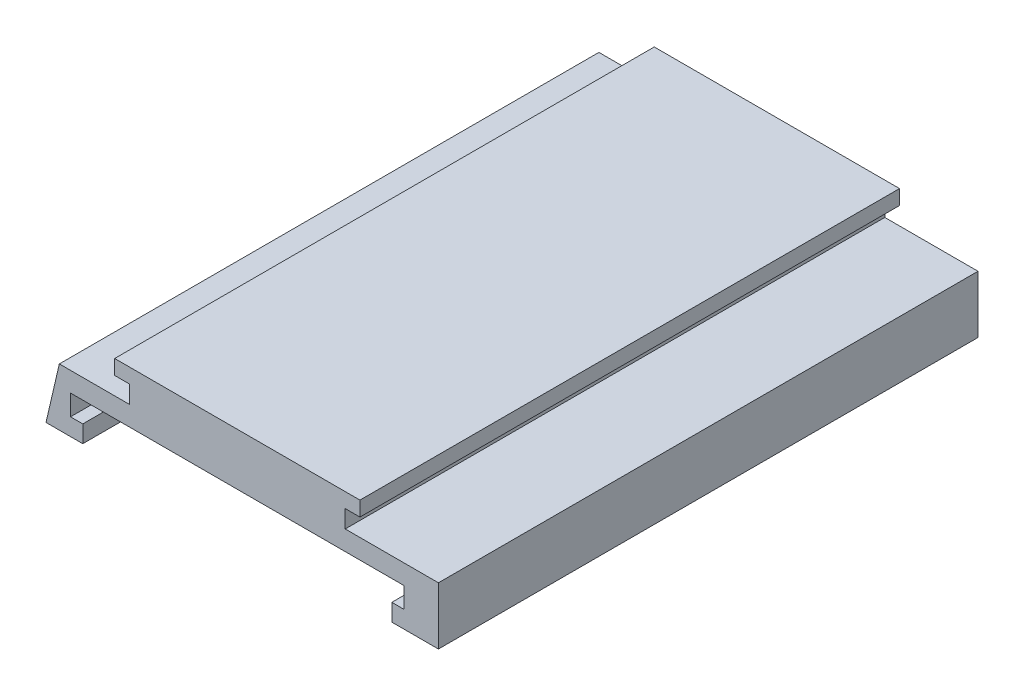
ISO-10303-21;
HEADER;
FILE_DESCRIPTION(('STEP AP214'),'2;1');
FILE_NAME('part.step','',(''),(''),'','','');
FILE_SCHEMA(('AUTOMOTIVE_DESIGN { 1 0 10303 214 1 1 1 1 }'));
ENDSEC;
DATA;
#1=APPLICATION_CONTEXT('core data for automotive mechanical design processes');
#2=APPLICATION_PROTOCOL_DEFINITION('international standard','automotive_design',2000,#1);
#3=PRODUCT_CONTEXT('',#1,'mechanical');
#4=PRODUCT('Part','Part','',(#3));
#5=PRODUCT_RELATED_PRODUCT_CATEGORY('part','',(#4));
#6=PRODUCT_DEFINITION_FORMATION('','',#4);
#7=PRODUCT_DEFINITION_CONTEXT('part definition',#1,'design');
#8=PRODUCT_DEFINITION('design','',#6,#7);
#9=PRODUCT_DEFINITION_SHAPE('','',#8);
#10=(LENGTH_UNIT() NAMED_UNIT(*) SI_UNIT(.MILLI.,.METRE.));
#11=(NAMED_UNIT(*) PLANE_ANGLE_UNIT() SI_UNIT($,.RADIAN.));
#12=(NAMED_UNIT(*) SI_UNIT($,.STERADIAN.) SOLID_ANGLE_UNIT());
#13=UNCERTAINTY_MEASURE_WITH_UNIT(LENGTH_MEASURE(1.E-05),#10,'distance_accuracy_value','');
#14=(GEOMETRIC_REPRESENTATION_CONTEXT(3) GLOBAL_UNCERTAINTY_ASSIGNED_CONTEXT((#13)) GLOBAL_UNIT_ASSIGNED_CONTEXT((#10,
#11,#12)) REPRESENTATION_CONTEXT('',''));
#15=CARTESIAN_POINT('',(0.,0.,0.));
#16=DIRECTION('',(0.,0.,1.));
#17=DIRECTION('',(1.,0.,0.));
#18=AXIS2_PLACEMENT_3D('',#15,#16,#17);
#19=CARTESIAN_POINT('',(0.,0.,55.));
#20=DIRECTION('',(0.,1.,0.));
#21=DIRECTION('',(0.,0.,1.));
#22=AXIS2_PLACEMENT_3D('',#19,#20,#21);
#23=PLANE('',#22);
#24=DIRECTION('',(1.,0.,0.));
#25=VECTOR('',#24,1.);
#26=CARTESIAN_POINT('',(0.,0.,55.));
#27=LINE('',#26,#25);
#28=CARTESIAN_POINT('',(1.,0.,55.));
#29=VERTEX_POINT('',#28);
#30=CARTESIAN_POINT('',(4.75,0.,55.));
#31=VERTEX_POINT('',#30);
#32=EDGE_CURVE('E131',#29,#31,#27,.T.);
#33=ORIENTED_EDGE('',*,*,#32,.F.);
#34=DIRECTION('',(0.,0.,1.));
#35=VECTOR('',#34,1.);
#36=CARTESIAN_POINT('',(1.,0.,-0.001000000000001));
#37=LINE('',#36,#35);
#38=CARTESIAN_POINT('',(1.,0.,0.));
#39=VERTEX_POINT('',#38);
#40=EDGE_CURVE('E351',#39,#29,#37,.T.);
#41=ORIENTED_EDGE('',*,*,#40,.F.);
#42=DIRECTION('',(1.,0.,0.));
#43=VECTOR('',#42,1.);
#44=CARTESIAN_POINT('',(0.,0.,0.));
#45=LINE('',#44,#43);
#46=CARTESIAN_POINT('',(4.75,0.,0.));
#47=VERTEX_POINT('',#46);
#48=EDGE_CURVE('E207',#39,#47,#45,.T.);
#49=ORIENTED_EDGE('',*,*,#48,.T.);
#50=DIRECTION('',(0.,0.,-1.));
#51=VECTOR('',#50,1.);
#52=CARTESIAN_POINT('',(4.75,0.,55.));
#53=LINE('',#52,#51);
#54=EDGE_CURVE('E11',#31,#47,#53,.T.);
#55=ORIENTED_EDGE('',*,*,#54,.F.);
#56=EDGE_LOOP('',(#33,#41,#49,#55));
#57=FACE_BOUND('',#56,.T.);
#58=ADVANCED_FACE('F37',(#57),#23,.F.);
#59=CARTESIAN_POINT('',(4.75,0.,55.));
#60=DIRECTION('',(-1.,0.,0.));
#61=DIRECTION('',(0.,0.,1.));
#62=AXIS2_PLACEMENT_3D('',#59,#60,#61);
#63=PLANE('',#62);
#64=DIRECTION('',(0.,1.,0.));
#65=VECTOR('',#64,1.);
#66=CARTESIAN_POINT('',(4.75,0.,0.));
#67=LINE('',#66,#65);
#68=CARTESIAN_POINT('',(4.75,1.75,0.));
#69=VERTEX_POINT('',#68);
#70=EDGE_CURVE('E209',#47,#69,#67,.T.);
#71=ORIENTED_EDGE('',*,*,#70,.T.);
#72=DIRECTION('',(0.,0.,-1.));
#73=VECTOR('',#72,1.);
#74=CARTESIAN_POINT('',(4.75,1.75,55.));
#75=LINE('',#74,#73);
#76=CARTESIAN_POINT('',(4.75,1.75,55.));
#77=VERTEX_POINT('',#76);
#78=EDGE_CURVE('E44',#77,#69,#75,.T.);
#79=ORIENTED_EDGE('',*,*,#78,.F.);
#80=DIRECTION('',(0.,1.,0.));
#81=VECTOR('',#80,1.);
#82=CARTESIAN_POINT('',(4.75,0.,55.));
#83=LINE('',#82,#81);
#84=EDGE_CURVE('E360',#31,#77,#83,.T.);
#85=ORIENTED_EDGE('',*,*,#84,.F.);
#86=ORIENTED_EDGE('',*,*,#54,.T.);
#87=EDGE_LOOP('',(#71,#79,#85,#86));
#88=FACE_BOUND('',#87,.T.);
#89=ADVANCED_FACE('F362',(#88),#63,.F.);
#90=CARTESIAN_POINT('',(4.75,1.75,55.));
#91=DIRECTION('',(0.,-1.,0.));
#92=DIRECTION('',(1.,0.,0.));
#93=AXIS2_PLACEMENT_3D('',#90,#91,#92);
#94=PLANE('',#93);
#95=DIRECTION('',(-1.,0.,0.));
#96=VECTOR('',#95,1.);
#97=CARTESIAN_POINT('',(4.75,1.75,0.));
#98=LINE('',#97,#96);
#99=CARTESIAN_POINT('',(3.5,1.75,0.));
#100=VERTEX_POINT('',#99);
#101=EDGE_CURVE('E211',#69,#100,#98,.T.);
#102=ORIENTED_EDGE('',*,*,#101,.T.);
#103=DIRECTION('',(0.,0.,-1.));
#104=VECTOR('',#103,1.);
#105=CARTESIAN_POINT('',(3.5,1.75,55.));
#106=LINE('',#105,#104);
#107=CARTESIAN_POINT('',(3.5,1.75,55.));
#108=VERTEX_POINT('',#107);
#109=EDGE_CURVE('E280',#108,#100,#106,.T.);
#110=ORIENTED_EDGE('',*,*,#109,.F.);
#111=DIRECTION('',(-1.,0.,0.));
#112=VECTOR('',#111,1.);
#113=CARTESIAN_POINT('',(4.75,1.75,55.));
#114=LINE('',#113,#112);
#115=EDGE_CURVE('E289',#77,#108,#114,.T.);
#116=ORIENTED_EDGE('',*,*,#115,.F.);
#117=ORIENTED_EDGE('',*,*,#78,.T.);
#118=EDGE_LOOP('',(#102,#110,#116,#117));
#119=FACE_BOUND('',#118,.T.);
#120=ADVANCED_FACE('F287',(#119),#94,.F.);
#121=CARTESIAN_POINT('',(3.5,1.75,55.));
#122=DIRECTION('',(-1.,0.,0.));
#123=DIRECTION('',(0.,0.,1.));
#124=AXIS2_PLACEMENT_3D('',#121,#122,#123);
#125=PLANE('',#124);
#126=DIRECTION('',(0.,1.,0.));
#127=VECTOR('',#126,1.);
#128=CARTESIAN_POINT('',(3.5,1.75,0.));
#129=LINE('',#128,#127);
#130=CARTESIAN_POINT('',(3.5,3.85,0.));
#131=VERTEX_POINT('',#130);
#132=EDGE_CURVE('E213',#100,#131,#129,.T.);
#133=ORIENTED_EDGE('',*,*,#132,.T.);
#134=DIRECTION('',(0.,0.,-1.));
#135=VECTOR('',#134,1.);
#136=CARTESIAN_POINT('',(3.5,3.85,55.));
#137=LINE('',#136,#135);
#138=CARTESIAN_POINT('',(3.5,3.85,55.));
#139=VERTEX_POINT('',#138);
#140=EDGE_CURVE('E277',#139,#131,#137,.T.);
#141=ORIENTED_EDGE('',*,*,#140,.F.);
#142=DIRECTION('',(0.,1.,0.));
#143=VECTOR('',#142,1.);
#144=CARTESIAN_POINT('',(3.5,1.75,55.));
#145=LINE('',#144,#143);
#146=EDGE_CURVE('E309',#108,#139,#145,.T.);
#147=ORIENTED_EDGE('',*,*,#146,.F.);
#148=ORIENTED_EDGE('',*,*,#109,.T.);
#149=EDGE_LOOP('',(#133,#141,#147,#148));
#150=FACE_BOUND('',#149,.T.);
#151=ADVANCED_FACE('F300',(#150),#125,.F.);
#152=CARTESIAN_POINT('',(3.5,3.85,55.));
#153=DIRECTION('',(0.,1.,0.));
#154=DIRECTION('',(-1.,0.,0.));
#155=AXIS2_PLACEMENT_3D('',#152,#153,#154);
#156=PLANE('',#155);
#157=DIRECTION('',(1.,0.,0.));
#158=VECTOR('',#157,1.);
#159=CARTESIAN_POINT('',(3.5,3.85,0.));
#160=LINE('',#159,#158);
#161=CARTESIAN_POINT('',(37.5,3.85,0.));
#162=VERTEX_POINT('',#161);
#163=EDGE_CURVE('E215',#131,#162,#160,.T.);
#164=ORIENTED_EDGE('',*,*,#163,.T.);
#165=DIRECTION('',(0.,0.,-1.));
#166=VECTOR('',#165,1.);
#167=CARTESIAN_POINT('',(37.5,3.85,55.));
#168=LINE('',#167,#166);
#169=CARTESIAN_POINT('',(37.5,3.85,55.));
#170=VERTEX_POINT('',#169);
#171=EDGE_CURVE('E274',#170,#162,#168,.T.);
#172=ORIENTED_EDGE('',*,*,#171,.F.);
#173=DIRECTION('',(1.,0.,0.));
#174=VECTOR('',#173,1.);
#175=CARTESIAN_POINT('',(3.5,3.85,55.));
#176=LINE('',#175,#174);
#177=EDGE_CURVE('E306',#139,#170,#176,.T.);
#178=ORIENTED_EDGE('',*,*,#177,.F.);
#179=ORIENTED_EDGE('',*,*,#140,.T.);
#180=EDGE_LOOP('',(#164,#172,#178,#179));
#181=FACE_BOUND('',#180,.T.);
#182=ADVANCED_FACE('F304',(#181),#156,.F.);
#183=CARTESIAN_POINT('',(37.5,3.85,55.));
#184=DIRECTION('',(1.,0.,0.));
#185=DIRECTION('',(0.,0.,-1.));
#186=AXIS2_PLACEMENT_3D('',#183,#184,#185);
#187=PLANE('',#186);
#188=DIRECTION('',(0.,-1.,0.));
#189=VECTOR('',#188,1.);
#190=CARTESIAN_POINT('',(37.5,3.85,0.));
#191=LINE('',#190,#189);
#192=CARTESIAN_POINT('',(37.5,1.75,0.));
#193=VERTEX_POINT('',#192);
#194=EDGE_CURVE('E217',#162,#193,#191,.T.);
#195=ORIENTED_EDGE('',*,*,#194,.T.);
#196=DIRECTION('',(0.,0.,-1.));
#197=VECTOR('',#196,1.);
#198=CARTESIAN_POINT('',(37.5,1.75,55.));
#199=LINE('',#198,#197);
#200=CARTESIAN_POINT('',(37.5,1.75,55.));
#201=VERTEX_POINT('',#200);
#202=EDGE_CURVE('E271',#201,#193,#199,.T.);
#203=ORIENTED_EDGE('',*,*,#202,.F.);
#204=DIRECTION('',(0.,-1.,0.));
#205=VECTOR('',#204,1.);
#206=CARTESIAN_POINT('',(37.5,3.85,55.));
#207=LINE('',#206,#205);
#208=EDGE_CURVE('E308',#170,#201,#207,.T.);
#209=ORIENTED_EDGE('',*,*,#208,.F.);
#210=ORIENTED_EDGE('',*,*,#171,.T.);
#211=EDGE_LOOP('',(#195,#203,#209,#210));
#212=FACE_BOUND('',#211,.T.);
#213=ADVANCED_FACE('F377',(#212),#187,.F.);
#214=CARTESIAN_POINT('',(37.5,1.75,55.));
#215=DIRECTION('',(0.,-1.,0.));
#216=DIRECTION('',(1.,0.,0.));
#217=AXIS2_PLACEMENT_3D('',#214,#215,#216);
#218=PLANE('',#217);
#219=DIRECTION('',(-1.,0.,0.));
#220=VECTOR('',#219,1.);
#221=CARTESIAN_POINT('',(37.5,1.75,0.));
#222=LINE('',#221,#220);
#223=CARTESIAN_POINT('',(36.25,1.75,0.));
#224=VERTEX_POINT('',#223);
#225=EDGE_CURVE('E219',#193,#224,#222,.T.);
#226=ORIENTED_EDGE('',*,*,#225,.T.);
#227=DIRECTION('',(0.,0.,-1.));
#228=VECTOR('',#227,1.);
#229=CARTESIAN_POINT('',(36.25,1.75,55.));
#230=LINE('',#229,#228);
#231=CARTESIAN_POINT('',(36.25,1.75,55.));
#232=VERTEX_POINT('',#231);
#233=EDGE_CURVE('E268',#232,#224,#230,.T.);
#234=ORIENTED_EDGE('',*,*,#233,.F.);
#235=DIRECTION('',(-1.,0.,0.));
#236=VECTOR('',#235,1.);
#237=CARTESIAN_POINT('',(37.5,1.75,55.));
#238=LINE('',#237,#236);
#239=EDGE_CURVE('E311',#201,#232,#238,.T.);
#240=ORIENTED_EDGE('',*,*,#239,.F.);
#241=ORIENTED_EDGE('',*,*,#202,.T.);
#242=EDGE_LOOP('',(#226,#234,#240,#241));
#243=FACE_BOUND('',#242,.T.);
#244=ADVANCED_FACE('F380',(#243),#218,.F.);
#245=CARTESIAN_POINT('',(36.25,1.75,55.));
#246=DIRECTION('',(1.,0.,0.));
#247=DIRECTION('',(0.,0.,-1.));
#248=AXIS2_PLACEMENT_3D('',#245,#246,#247);
#249=PLANE('',#248);
#250=DIRECTION('',(0.,-1.,0.));
#251=VECTOR('',#250,1.);
#252=CARTESIAN_POINT('',(36.25,1.75,0.));
#253=LINE('',#252,#251);
#254=CARTESIAN_POINT('',(36.25,0.,0.));
#255=VERTEX_POINT('',#254);
#256=EDGE_CURVE('E221',#224,#255,#253,.T.);
#257=ORIENTED_EDGE('',*,*,#256,.T.);
#258=DIRECTION('',(0.,0.,-1.));
#259=VECTOR('',#258,1.);
#260=CARTESIAN_POINT('',(36.25,0.,55.));
#261=LINE('',#260,#259);
#262=CARTESIAN_POINT('',(36.25,0.,55.));
#263=VERTEX_POINT('',#262);
#264=EDGE_CURVE('E265',#263,#255,#261,.T.);
#265=ORIENTED_EDGE('',*,*,#264,.F.);
#266=DIRECTION('',(0.,-1.,0.));
#267=VECTOR('',#266,1.);
#268=CARTESIAN_POINT('',(36.25,1.75,55.));
#269=LINE('',#268,#267);
#270=EDGE_CURVE('E317',#232,#263,#269,.T.);
#271=ORIENTED_EDGE('',*,*,#270,.F.);
#272=ORIENTED_EDGE('',*,*,#233,.T.);
#273=EDGE_LOOP('',(#257,#265,#271,#272));
#274=FACE_BOUND('',#273,.T.);
#275=ADVANCED_FACE('F384',(#274),#249,.F.);
#276=CARTESIAN_POINT('',(36.25,0.,55.));
#277=DIRECTION('',(0.,1.,0.));
#278=DIRECTION('',(-1.,0.,0.));
#279=AXIS2_PLACEMENT_3D('',#276,#277,#278);
#280=PLANE('',#279);
#281=DIRECTION('',(1.,0.,0.));
#282=VECTOR('',#281,1.);
#283=CARTESIAN_POINT('',(36.25,0.,0.));
#284=LINE('',#283,#282);
#285=CARTESIAN_POINT('',(41.,0.,0.));
#286=VERTEX_POINT('',#285);
#287=EDGE_CURVE('E223',#255,#286,#284,.T.);
#288=ORIENTED_EDGE('',*,*,#287,.T.);
#289=DIRECTION('',(0.,0.,-1.));
#290=VECTOR('',#289,1.);
#291=CARTESIAN_POINT('',(41.,0.,55.));
#292=LINE('',#291,#290);
#293=CARTESIAN_POINT('',(41.,0.,55.));
#294=VERTEX_POINT('',#293);
#295=EDGE_CURVE('E262',#294,#286,#292,.T.);
#296=ORIENTED_EDGE('',*,*,#295,.F.);
#297=DIRECTION('',(1.,0.,0.));
#298=VECTOR('',#297,1.);
#299=CARTESIAN_POINT('',(36.25,0.,55.));
#300=LINE('',#299,#298);
#301=EDGE_CURVE('E319',#263,#294,#300,.T.);
#302=ORIENTED_EDGE('',*,*,#301,.F.);
#303=ORIENTED_EDGE('',*,*,#264,.T.);
#304=EDGE_LOOP('',(#288,#296,#302,#303));
#305=FACE_BOUND('',#304,.T.);
#306=ADVANCED_FACE('F388',(#305),#280,.F.);
#307=CARTESIAN_POINT('',(41.,0.,55.));
#308=DIRECTION('',(-1.,0.,0.));
#309=DIRECTION('',(0.,0.,1.));
#310=AXIS2_PLACEMENT_3D('',#307,#308,#309);
#311=PLANE('',#310);
#312=DIRECTION('',(0.,1.,0.));
#313=VECTOR('',#312,1.);
#314=CARTESIAN_POINT('',(41.,0.,0.));
#315=LINE('',#314,#313);
#316=CARTESIAN_POINT('',(41.,5.84999999999999,0.));
#317=VERTEX_POINT('',#316);
#318=EDGE_CURVE('E225',#286,#317,#315,.T.);
#319=ORIENTED_EDGE('',*,*,#318,.T.);
#320=DIRECTION('',(0.,0.,-1.));
#321=VECTOR('',#320,1.);
#322=CARTESIAN_POINT('',(41.,5.84999999999999,55.));
#323=LINE('',#322,#321);
#324=CARTESIAN_POINT('',(41.,5.84999999999999,55.));
#325=VERTEX_POINT('',#324);
#326=EDGE_CURVE('E259',#325,#317,#323,.T.);
#327=ORIENTED_EDGE('',*,*,#326,.F.);
#328=DIRECTION('',(0.,1.,0.));
#329=VECTOR('',#328,1.);
#330=CARTESIAN_POINT('',(41.,0.,55.));
#331=LINE('',#330,#329);
#332=EDGE_CURVE('E321',#294,#325,#331,.T.);
#333=ORIENTED_EDGE('',*,*,#332,.F.);
#334=ORIENTED_EDGE('',*,*,#295,.T.);
#335=EDGE_LOOP('',(#319,#327,#333,#334));
#336=FACE_BOUND('',#335,.T.);
#337=ADVANCED_FACE('F392',(#336),#311,.F.);
#338=CARTESIAN_POINT('',(31.5,5.85,55.));
#339=DIRECTION('',(0.,-1.,0.));
#340=DIRECTION('',(1.,0.,0.));
#341=AXIS2_PLACEMENT_3D('',#338,#339,#340);
#342=PLANE('',#341);
#343=DIRECTION('',(-1.,0.,0.));
#344=VECTOR('',#343,1.);
#345=CARTESIAN_POINT('',(31.5,5.85,0.));
#346=LINE('',#345,#344);
#347=CARTESIAN_POINT('',(31.5,5.85,0.));
#348=VERTEX_POINT('',#347);
#349=EDGE_CURVE('E227',#317,#348,#346,.T.);
#350=ORIENTED_EDGE('',*,*,#349,.T.);
#351=DIRECTION('',(0.,0.,-1.));
#352=VECTOR('',#351,1.);
#353=CARTESIAN_POINT('',(31.5,5.85,55.));
#354=LINE('',#353,#352);
#355=CARTESIAN_POINT('',(31.5,5.85,55.));
#356=VERTEX_POINT('',#355);
#357=EDGE_CURVE('E256',#356,#348,#354,.T.);
#358=ORIENTED_EDGE('',*,*,#357,.F.);
#359=DIRECTION('',(-1.,0.,0.));
#360=VECTOR('',#359,1.);
#361=CARTESIAN_POINT('',(31.5,5.85,55.));
#362=LINE('',#361,#360);
#363=EDGE_CURVE('E323',#325,#356,#362,.T.);
#364=ORIENTED_EDGE('',*,*,#363,.F.);
#365=ORIENTED_EDGE('',*,*,#326,.T.);
#366=EDGE_LOOP('',(#350,#358,#364,#365));
#367=FACE_BOUND('',#366,.T.);
#368=ADVANCED_FACE('F396',(#367),#342,.F.);
#369=CARTESIAN_POINT('',(31.5,7.65,55.));
#370=DIRECTION('',(-1.,0.,0.));
#371=DIRECTION('',(0.,0.,1.));
#372=AXIS2_PLACEMENT_3D('',#369,#370,#371);
#373=PLANE('',#372);
#374=DIRECTION('',(0.,1.,0.));
#375=VECTOR('',#374,1.);
#376=CARTESIAN_POINT('',(31.5,7.65,0.));
#377=LINE('',#376,#375);
#378=CARTESIAN_POINT('',(31.5,7.65,0.));
#379=VERTEX_POINT('',#378);
#380=EDGE_CURVE('E229',#348,#379,#377,.T.);
#381=ORIENTED_EDGE('',*,*,#380,.T.);
#382=DIRECTION('',(0.,0.,-1.));
#383=VECTOR('',#382,1.);
#384=CARTESIAN_POINT('',(31.5,7.65,55.));
#385=LINE('',#384,#383);
#386=CARTESIAN_POINT('',(31.5,7.65,55.));
#387=VERTEX_POINT('',#386);
#388=EDGE_CURVE('E253',#387,#379,#385,.T.);
#389=ORIENTED_EDGE('',*,*,#388,.F.);
#390=DIRECTION('',(0.,1.,0.));
#391=VECTOR('',#390,1.);
#392=CARTESIAN_POINT('',(31.5,7.65,55.));
#393=LINE('',#392,#391);
#394=EDGE_CURVE('E325',#356,#387,#393,.T.);
#395=ORIENTED_EDGE('',*,*,#394,.F.);
#396=ORIENTED_EDGE('',*,*,#357,.T.);
#397=EDGE_LOOP('',(#381,#389,#395,#396));
#398=FACE_BOUND('',#397,.T.);
#399=ADVANCED_FACE('F400',(#398),#373,.F.);
#400=CARTESIAN_POINT('',(33.,7.65,55.));
#401=DIRECTION('',(0.,1.,0.));
#402=DIRECTION('',(0.,0.,1.));
#403=AXIS2_PLACEMENT_3D('',#400,#401,#402);
#404=PLANE('',#403);
#405=DIRECTION('',(1.,0.,0.));
#406=VECTOR('',#405,1.);
#407=CARTESIAN_POINT('',(33.,7.65,0.));
#408=LINE('',#407,#406);
#409=CARTESIAN_POINT('',(33.,7.65,0.));
#410=VERTEX_POINT('',#409);
#411=EDGE_CURVE('E231',#379,#410,#408,.T.);
#412=ORIENTED_EDGE('',*,*,#411,.T.);
#413=DIRECTION('',(0.,0.,-1.));
#414=VECTOR('',#413,1.);
#415=CARTESIAN_POINT('',(33.,7.65,55.));
#416=LINE('',#415,#414);
#417=CARTESIAN_POINT('',(33.,7.65,55.));
#418=VERTEX_POINT('',#417);
#419=EDGE_CURVE('E250',#418,#410,#416,.T.);
#420=ORIENTED_EDGE('',*,*,#419,.F.);
#421=DIRECTION('',(1.,0.,0.));
#422=VECTOR('',#421,1.);
#423=CARTESIAN_POINT('',(33.,7.65,55.));
#424=LINE('',#423,#422);
#425=EDGE_CURVE('E327',#387,#418,#424,.T.);
#426=ORIENTED_EDGE('',*,*,#425,.F.);
#427=ORIENTED_EDGE('',*,*,#388,.T.);
#428=EDGE_LOOP('',(#412,#420,#426,#427));
#429=FACE_BOUND('',#428,.T.);
#430=ADVANCED_FACE('F404',(#429),#404,.F.);
#431=CARTESIAN_POINT('',(33.,9.15,55.));
#432=DIRECTION('',(-1.,0.,0.));
#433=DIRECTION('',(0.,0.,1.));
#434=AXIS2_PLACEMENT_3D('',#431,#432,#433);
#435=PLANE('',#434);
#436=DIRECTION('',(0.,1.,0.));
#437=VECTOR('',#436,1.);
#438=CARTESIAN_POINT('',(33.,9.15,0.));
#439=LINE('',#438,#437);
#440=CARTESIAN_POINT('',(33.,9.15,0.));
#441=VERTEX_POINT('',#440);
#442=EDGE_CURVE('E233',#410,#441,#439,.T.);
#443=ORIENTED_EDGE('',*,*,#442,.T.);
#444=DIRECTION('',(0.,0.,-1.));
#445=VECTOR('',#444,1.);
#446=CARTESIAN_POINT('',(33.,9.15,55.));
#447=LINE('',#446,#445);
#448=CARTESIAN_POINT('',(33.,9.15,55.));
#449=VERTEX_POINT('',#448);
#450=EDGE_CURVE('E247',#449,#441,#447,.T.);
#451=ORIENTED_EDGE('',*,*,#450,.F.);
#452=DIRECTION('',(0.,1.,0.));
#453=VECTOR('',#452,1.);
#454=CARTESIAN_POINT('',(33.,9.15,55.));
#455=LINE('',#454,#453);
#456=EDGE_CURVE('E329',#418,#449,#455,.T.);
#457=ORIENTED_EDGE('',*,*,#456,.F.);
#458=ORIENTED_EDGE('',*,*,#419,.T.);
#459=EDGE_LOOP('',(#443,#451,#457,#458));
#460=FACE_BOUND('',#459,.T.);
#461=ADVANCED_FACE('F335',(#460),#435,.F.);
#462=CARTESIAN_POINT('',(8.,9.15,55.));
#463=DIRECTION('',(0.,-1.,0.));
#464=DIRECTION('',(1.,0.,0.));
#465=AXIS2_PLACEMENT_3D('',#462,#463,#464);
#466=PLANE('',#465);
#467=DIRECTION('',(-1.,0.,0.));
#468=VECTOR('',#467,1.);
#469=CARTESIAN_POINT('',(8.,9.15,0.));
#470=LINE('',#469,#468);
#471=CARTESIAN_POINT('',(8.,9.15,0.));
#472=VERTEX_POINT('',#471);
#473=EDGE_CURVE('E235',#441,#472,#470,.T.);
#474=ORIENTED_EDGE('',*,*,#473,.T.);
#475=DIRECTION('',(0.,0.,-1.));
#476=VECTOR('',#475,1.);
#477=CARTESIAN_POINT('',(8.,9.15,55.));
#478=LINE('',#477,#476);
#479=CARTESIAN_POINT('',(8.,9.15,55.));
#480=VERTEX_POINT('',#479);
#481=EDGE_CURVE('E196',#480,#472,#478,.T.);
#482=ORIENTED_EDGE('',*,*,#481,.F.);
#483=DIRECTION('',(-1.,0.,0.));
#484=VECTOR('',#483,1.);
#485=CARTESIAN_POINT('',(8.,9.15,55.));
#486=LINE('',#485,#484);
#487=EDGE_CURVE('E184',#449,#480,#486,.T.);
#488=ORIENTED_EDGE('',*,*,#487,.F.);
#489=ORIENTED_EDGE('',*,*,#450,.T.);
#490=EDGE_LOOP('',(#474,#482,#488,#489));
#491=FACE_BOUND('',#490,.T.);
#492=ADVANCED_FACE('F339',(#491),#466,.F.);
#493=CARTESIAN_POINT('',(8.,7.65,55.));
#494=DIRECTION('',(1.,0.,0.));
#495=DIRECTION('',(0.,0.,-1.));
#496=AXIS2_PLACEMENT_3D('',#493,#494,#495);
#497=PLANE('',#496);
#498=DIRECTION('',(0.,-1.,0.));
#499=VECTOR('',#498,1.);
#500=CARTESIAN_POINT('',(8.,7.65,0.));
#501=LINE('',#500,#499);
#502=CARTESIAN_POINT('',(8.,7.65,0.));
#503=VERTEX_POINT('',#502);
#504=EDGE_CURVE('E193',#472,#503,#501,.T.);
#505=ORIENTED_EDGE('',*,*,#504,.T.);
#506=DIRECTION('',(0.,0.,-1.));
#507=VECTOR('',#506,1.);
#508=CARTESIAN_POINT('',(8.,7.65,55.));
#509=LINE('',#508,#507);
#510=CARTESIAN_POINT('',(8.,7.65,55.));
#511=VERTEX_POINT('',#510);
#512=EDGE_CURVE('E190',#511,#503,#509,.T.);
#513=ORIENTED_EDGE('',*,*,#512,.F.);
#514=DIRECTION('',(0.,-1.,0.));
#515=VECTOR('',#514,1.);
#516=CARTESIAN_POINT('',(8.,7.65,55.));
#517=LINE('',#516,#515);
#518=EDGE_CURVE('E177',#480,#511,#517,.T.);
#519=ORIENTED_EDGE('',*,*,#518,.F.);
#520=ORIENTED_EDGE('',*,*,#481,.T.);
#521=EDGE_LOOP('',(#505,#513,#519,#520));
#522=FACE_BOUND('',#521,.T.);
#523=ADVANCED_FACE('F191',(#522),#497,.F.);
#524=CARTESIAN_POINT('',(9.5,7.65,55.));
#525=DIRECTION('',(0.,1.,0.));
#526=DIRECTION('',(0.,0.,1.));
#527=AXIS2_PLACEMENT_3D('',#524,#525,#526);
#528=PLANE('',#527);
#529=DIRECTION('',(1.,0.,0.));
#530=VECTOR('',#529,1.);
#531=CARTESIAN_POINT('',(9.5,7.65,0.));
#532=LINE('',#531,#530);
#533=CARTESIAN_POINT('',(9.5,7.65,0.));
#534=VERTEX_POINT('',#533);
#535=EDGE_CURVE('E238',#503,#534,#532,.T.);
#536=ORIENTED_EDGE('',*,*,#535,.T.);
#537=DIRECTION('',(0.,0.,-1.));
#538=VECTOR('',#537,1.);
#539=CARTESIAN_POINT('',(9.5,7.65,55.));
#540=LINE('',#539,#538);
#541=CARTESIAN_POINT('',(9.5,7.65,55.));
#542=VERTEX_POINT('',#541);
#543=EDGE_CURVE('E197',#542,#534,#540,.T.);
#544=ORIENTED_EDGE('',*,*,#543,.F.);
#545=DIRECTION('',(1.,0.,0.));
#546=VECTOR('',#545,1.);
#547=CARTESIAN_POINT('',(9.5,7.65,55.));
#548=LINE('',#547,#546);
#549=EDGE_CURVE('E181',#511,#542,#548,.T.);
#550=ORIENTED_EDGE('',*,*,#549,.F.);
#551=ORIENTED_EDGE('',*,*,#512,.T.);
#552=EDGE_LOOP('',(#536,#544,#550,#551));
#553=FACE_BOUND('',#552,.T.);
#554=ADVANCED_FACE('F199',(#553),#528,.F.);
#555=CARTESIAN_POINT('',(9.5,5.85,55.));
#556=DIRECTION('',(1.,0.,0.));
#557=DIRECTION('',(0.,0.,-1.));
#558=AXIS2_PLACEMENT_3D('',#555,#556,#557);
#559=PLANE('',#558);
#560=DIRECTION('',(0.,-1.,0.));
#561=VECTOR('',#560,1.);
#562=CARTESIAN_POINT('',(9.5,5.85,0.));
#563=LINE('',#562,#561);
#564=CARTESIAN_POINT('',(9.5,5.85,0.));
#565=VERTEX_POINT('',#564);
#566=EDGE_CURVE('E123',#534,#565,#563,.T.);
#567=ORIENTED_EDGE('',*,*,#566,.T.);
#568=DIRECTION('',(0.,0.,-1.));
#569=VECTOR('',#568,1.);
#570=CARTESIAN_POINT('',(9.5,5.85,55.));
#571=LINE('',#570,#569);
#572=CARTESIAN_POINT('',(9.5,5.85,55.));
#573=VERTEX_POINT('',#572);
#574=EDGE_CURVE('E206',#573,#565,#571,.T.);
#575=ORIENTED_EDGE('',*,*,#574,.F.);
#576=DIRECTION('',(0.,-1.,0.));
#577=VECTOR('',#576,1.);
#578=CARTESIAN_POINT('',(9.5,5.85,55.));
#579=LINE('',#578,#577);
#580=EDGE_CURVE('E60',#542,#573,#579,.T.);
#581=ORIENTED_EDGE('',*,*,#580,.F.);
#582=ORIENTED_EDGE('',*,*,#543,.T.);
#583=EDGE_LOOP('',(#567,#575,#581,#582));
#584=FACE_BOUND('',#583,.T.);
#585=ADVANCED_FACE('F341',(#584),#559,.F.);
#586=CARTESIAN_POINT('',(0.,5.84999999999999,55.));
#587=DIRECTION('',(0.,-1.,0.));
#588=DIRECTION('',(1.,0.,0.));
#589=AXIS2_PLACEMENT_3D('',#586,#587,#588);
#590=PLANE('',#589);
#591=DIRECTION('',(-1.,0.,0.));
#592=VECTOR('',#591,1.);
#593=CARTESIAN_POINT('',(0.,5.84999999999999,0.));
#594=LINE('',#593,#592);
#595=CARTESIAN_POINT('',(2.3583951814125,5.85,0.));
#596=VERTEX_POINT('',#595);
#597=EDGE_CURVE('E241',#565,#596,#594,.T.);
#598=ORIENTED_EDGE('',*,*,#597,.T.);
#599=DIRECTION('',(0.,0.,1.));
#600=VECTOR('',#599,1.);
#601=CARTESIAN_POINT('',(2.3583951814125,5.85,-0.001000000000001));
#602=LINE('',#601,#600);
#603=CARTESIAN_POINT('',(2.3583951814125,5.85,55.));
#604=VERTEX_POINT('',#603);
#605=EDGE_CURVE('E51',#596,#604,#602,.T.);
#606=ORIENTED_EDGE('',*,*,#605,.T.);
#607=DIRECTION('',(-1.,0.,0.));
#608=VECTOR('',#607,1.);
#609=CARTESIAN_POINT('',(0.,5.84999999999999,55.));
#610=LINE('',#609,#608);
#611=EDGE_CURVE('E201',#573,#604,#610,.T.);
#612=ORIENTED_EDGE('',*,*,#611,.F.);
#613=ORIENTED_EDGE('',*,*,#574,.T.);
#614=EDGE_LOOP('',(#598,#606,#612,#613));
#615=FACE_BOUND('',#614,.T.);
#616=ADVANCED_FACE('F344',(#615),#590,.F.);
#617=CARTESIAN_POINT('',(0.,0.,55.));
#618=DIRECTION('',(0.,0.,1.));
#619=DIRECTION('',(1.,0.,0.));
#620=AXIS2_PLACEMENT_3D('',#617,#618,#619);
#621=PLANE('',#620);
#622=DIRECTION('',(0.226186501058695,0.97408401420967,0.));
#623=VECTOR('',#622,1.);
#624=CARTESIAN_POINT('',(1.,0.,55.));
#625=LINE('',#624,#623);
#626=EDGE_CURVE('E347',#29,#604,#625,.T.);
#627=ORIENTED_EDGE('',*,*,#626,.F.);
#628=ORIENTED_EDGE('',*,*,#32,.T.);
#629=ORIENTED_EDGE('',*,*,#84,.T.);
#630=ORIENTED_EDGE('',*,*,#115,.T.);
#631=ORIENTED_EDGE('',*,*,#146,.T.);
#632=ORIENTED_EDGE('',*,*,#177,.T.);
#633=ORIENTED_EDGE('',*,*,#208,.T.);
#634=ORIENTED_EDGE('',*,*,#239,.T.);
#635=ORIENTED_EDGE('',*,*,#270,.T.);
#636=ORIENTED_EDGE('',*,*,#301,.T.);
#637=ORIENTED_EDGE('',*,*,#332,.T.);
#638=ORIENTED_EDGE('',*,*,#363,.T.);
#639=ORIENTED_EDGE('',*,*,#394,.T.);
#640=ORIENTED_EDGE('',*,*,#425,.T.);
#641=ORIENTED_EDGE('',*,*,#456,.T.);
#642=ORIENTED_EDGE('',*,*,#487,.T.);
#643=ORIENTED_EDGE('',*,*,#518,.T.);
#644=ORIENTED_EDGE('',*,*,#549,.T.);
#645=ORIENTED_EDGE('',*,*,#580,.T.);
#646=ORIENTED_EDGE('',*,*,#611,.T.);
#647=EDGE_LOOP('',(#627,#628,#629,#630,#631,#632,#633,#634,#635,#636,#637,#638,#639,#640,#641,
#642,#643,#644,#645,#646));
#648=FACE_BOUND('',#647,.T.);
#649=ADVANCED_FACE('F179',(#648),#621,.T.);
#650=CARTESIAN_POINT('',(0.,0.,0.));
#651=DIRECTION('',(0.,0.,1.));
#652=DIRECTION('',(1.,0.,0.));
#653=AXIS2_PLACEMENT_3D('',#650,#651,#652);
#654=PLANE('',#653);
#655=ORIENTED_EDGE('',*,*,#48,.F.);
#656=DIRECTION('',(-0.226186501058695,-0.97408401420967,0.));
#657=VECTOR('',#656,1.);
#658=CARTESIAN_POINT('',(1.,0.,0.));
#659=LINE('',#658,#657);
#660=EDGE_CURVE('E353',#596,#39,#659,.T.);
#661=ORIENTED_EDGE('',*,*,#660,.F.);
#662=ORIENTED_EDGE('',*,*,#597,.F.);
#663=ORIENTED_EDGE('',*,*,#566,.F.);
#664=ORIENTED_EDGE('',*,*,#535,.F.);
#665=ORIENTED_EDGE('',*,*,#504,.F.);
#666=ORIENTED_EDGE('',*,*,#473,.F.);
#667=ORIENTED_EDGE('',*,*,#442,.F.);
#668=ORIENTED_EDGE('',*,*,#411,.F.);
#669=ORIENTED_EDGE('',*,*,#380,.F.);
#670=ORIENTED_EDGE('',*,*,#349,.F.);
#671=ORIENTED_EDGE('',*,*,#318,.F.);
#672=ORIENTED_EDGE('',*,*,#287,.F.);
#673=ORIENTED_EDGE('',*,*,#256,.F.);
#674=ORIENTED_EDGE('',*,*,#225,.F.);
#675=ORIENTED_EDGE('',*,*,#194,.F.);
#676=ORIENTED_EDGE('',*,*,#163,.F.);
#677=ORIENTED_EDGE('',*,*,#132,.F.);
#678=ORIENTED_EDGE('',*,*,#101,.F.);
#679=ORIENTED_EDGE('',*,*,#70,.F.);
#680=EDGE_LOOP('',(#655,#661,#662,#663,#664,#665,#666,#667,#668,#669,#670,#671,#672,#673,#674,
#675,#676,#677,#678,#679));
#681=FACE_BOUND('',#680,.T.);
#682=ADVANCED_FACE('F295',(#681),#654,.F.);
#683=CARTESIAN_POINT('',(1.,0.,-0.001000000000001));
#684=DIRECTION('',(0.97408401420967,-0.226186501058695,0.));
#685=DIRECTION('',(0.226186501058695,0.97408401420967,0.));
#686=AXIS2_PLACEMENT_3D('',#683,#684,#685);
#687=PLANE('',#686);
#688=ORIENTED_EDGE('',*,*,#660,.T.);
#689=ORIENTED_EDGE('',*,*,#40,.T.);
#690=ORIENTED_EDGE('',*,*,#626,.T.);
#691=ORIENTED_EDGE('',*,*,#605,.F.);
#692=EDGE_LOOP('',(#688,#689,#690,#691));
#693=FACE_BOUND('',#692,.T.);
#694=ADVANCED_FACE('F352',(#693),#687,.F.);
#695=CLOSED_SHELL('',(#58,#89,#120,#151,#182,#213,#244,#275,#306,#337,#368,#399,#430,#461,#492,
#523,#554,#585,#616,#649,#682,#694));
#696=MANIFOLD_SOLID_BREP('B2',#695);
#697=ADVANCED_BREP_SHAPE_REPRESENTATION('',(#18,#696),#14);
#698=SHAPE_DEFINITION_REPRESENTATION(#9,#697);
ENDSEC;
END-ISO-10303-21;
